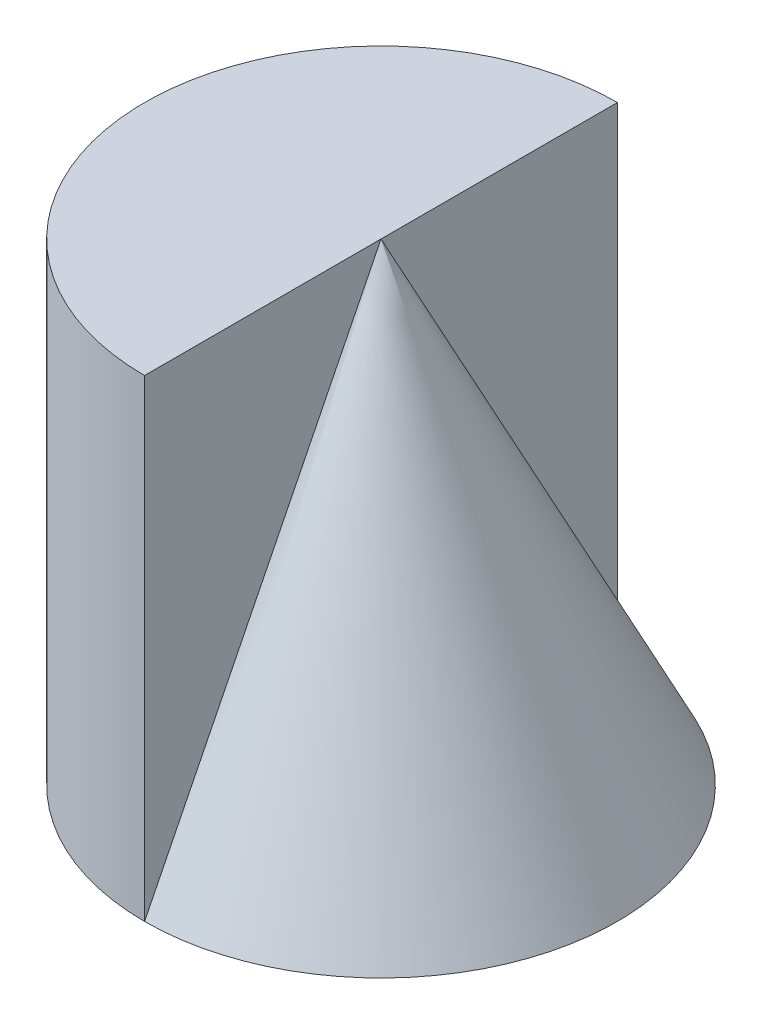
ISO-10303-21;
HEADER;
FILE_DESCRIPTION(('STEP AP214'),'2;1');
FILE_NAME('part.step','',(''),(''),'','','');
FILE_SCHEMA(('AUTOMOTIVE_DESIGN { 1 0 10303 214 1 1 1 1 }'));
ENDSEC;
DATA;
#1=APPLICATION_CONTEXT('core data for automotive mechanical design processes');
#2=APPLICATION_PROTOCOL_DEFINITION('international standard','automotive_design',2000,#1);
#3=PRODUCT_CONTEXT('',#1,'mechanical');
#4=PRODUCT('Part','Part','',(#3));
#5=PRODUCT_RELATED_PRODUCT_CATEGORY('part','',(#4));
#6=PRODUCT_DEFINITION_FORMATION('','',#4);
#7=PRODUCT_DEFINITION_CONTEXT('part definition',#1,'design');
#8=PRODUCT_DEFINITION('design','',#6,#7);
#9=PRODUCT_DEFINITION_SHAPE('','',#8);
#10=(LENGTH_UNIT() NAMED_UNIT(*) SI_UNIT(.MILLI.,.METRE.));
#11=(NAMED_UNIT(*) PLANE_ANGLE_UNIT() SI_UNIT($,.RADIAN.));
#12=(NAMED_UNIT(*) SI_UNIT($,.STERADIAN.) SOLID_ANGLE_UNIT());
#13=UNCERTAINTY_MEASURE_WITH_UNIT(LENGTH_MEASURE(1.E-05),#10,'distance_accuracy_value','');
#14=(GEOMETRIC_REPRESENTATION_CONTEXT(3) GLOBAL_UNCERTAINTY_ASSIGNED_CONTEXT((#13)) GLOBAL_UNIT_ASSIGNED_CONTEXT((#10,
#11,#12)) REPRESENTATION_CONTEXT('',''));
#15=CARTESIAN_POINT('',(0.,0.,0.));
#16=DIRECTION('',(0.,0.,1.));
#17=DIRECTION('',(1.,0.,0.));
#18=AXIS2_PLACEMENT_3D('',#15,#16,#17);
#19=CARTESIAN_POINT('',(0.,0.,4.));
#20=DIRECTION('',(0.,1.,0.));
#21=DIRECTION('',(0.,0.,1.));
#22=AXIS2_PLACEMENT_3D('',#19,#20,#21);
#23=PLANE('',#22);
#24=CARTESIAN_POINT('',(2.,0.,2.));
#25=DIRECTION('',(0.,1.,0.));
#26=DIRECTION('',(0.,0.,1.));
#27=AXIS2_PLACEMENT_3D('',#24,#25,#26);
#28=CIRCLE('',#27,2.);
#29=CARTESIAN_POINT('',(2.,0.,0.));
#30=VERTEX_POINT('',#29);
#31=CARTESIAN_POINT('',(1.99999999999999,0.,4.));
#32=VERTEX_POINT('',#31);
#33=EDGE_CURVE('E57',#30,#32,#28,.T.);
#34=ORIENTED_EDGE('',*,*,#33,.F.);
#35=CARTESIAN_POINT('',(2.,0.,2.));
#36=DIRECTION('',(0.,1.,0.));
#37=DIRECTION('',(0.,0.,1.));
#38=AXIS2_PLACEMENT_3D('',#35,#36,#37);
#39=CIRCLE('',#38,2.);
#40=EDGE_CURVE('E67',#32,#30,#39,.T.);
#41=ORIENTED_EDGE('',*,*,#40,.F.);
#42=EDGE_LOOP('',(#34,#41));
#43=FACE_BOUND('',#42,.T.);
#44=ADVANCED_FACE('F35',(#43),#23,.F.);
#45=CARTESIAN_POINT('',(0.,4.,4.));
#46=DIRECTION('',(0.,-1.,0.));
#47=DIRECTION('',(0.,0.,-1.));
#48=AXIS2_PLACEMENT_3D('',#45,#46,#47);
#49=PLANE('',#48);
#50=DIRECTION('',(0.,0.,-1.));
#51=VECTOR('',#50,1.);
#52=CARTESIAN_POINT('',(2.,4.,4.));
#53=LINE('',#52,#51);
#54=CARTESIAN_POINT('',(2.,4.,2.));
#55=VERTEX_POINT('',#54);
#56=CARTESIAN_POINT('',(2.,4.,0.));
#57=VERTEX_POINT('',#56);
#58=EDGE_CURVE('E42',#55,#57,#53,.T.);
#59=ORIENTED_EDGE('',*,*,#58,.T.);
#60=CARTESIAN_POINT('',(2.,4.,2.));
#61=DIRECTION('',(0.,1.,0.));
#62=DIRECTION('',(0.,0.,1.));
#63=AXIS2_PLACEMENT_3D('',#60,#61,#62);
#64=CIRCLE('',#63,2.);
#65=CARTESIAN_POINT('',(2.,4.,4.));
#66=VERTEX_POINT('',#65);
#67=EDGE_CURVE('E69',#57,#66,#64,.T.);
#68=ORIENTED_EDGE('',*,*,#67,.T.);
#69=EDGE_CURVE('E11',#66,#55,#53,.T.);
#70=ORIENTED_EDGE('',*,*,#69,.T.);
#71=EDGE_LOOP('',(#59,#68,#70));
#72=FACE_BOUND('',#71,.T.);
#73=ADVANCED_FACE('F88',(#72),#49,.F.);
#74=CARTESIAN_POINT('',(2.,0.,4.));
#75=DIRECTION('',(-1.,0.,0.));
#76=DIRECTION('',(0.,0.,1.));
#77=AXIS2_PLACEMENT_3D('',#74,#75,#76);
#78=PLANE('',#77);
#79=DIRECTION('',(0.,0.894427190999916,0.447213595499958));
#80=VECTOR('',#79,1.);
#81=CARTESIAN_POINT('',(2.,4.,2.));
#82=LINE('',#81,#80);
#83=EDGE_CURVE('E68',#30,#55,#82,.T.);
#84=ORIENTED_EDGE('',*,*,#83,.F.);
#85=DIRECTION('',(0.,1.,0.));
#86=VECTOR('',#85,1.);
#87=CARTESIAN_POINT('',(2.,0.,0.));
#88=LINE('',#87,#86);
#89=EDGE_CURVE('E72',#30,#57,#88,.T.);
#90=ORIENTED_EDGE('',*,*,#89,.T.);
#91=ORIENTED_EDGE('',*,*,#58,.F.);
#92=EDGE_LOOP('',(#84,#90,#91));
#93=FACE_BOUND('',#92,.T.);
#94=ADVANCED_FACE('F80',(#93),#78,.F.);
#95=DIRECTION('',(0.,0.894427190999916,-0.447213595499958));
#96=VECTOR('',#95,1.);
#97=CARTESIAN_POINT('',(2.,4.,2.));
#98=LINE('',#97,#96);
#99=EDGE_CURVE('E49',#32,#55,#98,.T.);
#100=ORIENTED_EDGE('',*,*,#99,.T.);
#101=ORIENTED_EDGE('',*,*,#69,.F.);
#102=DIRECTION('',(0.,1.,0.));
#103=VECTOR('',#102,1.);
#104=CARTESIAN_POINT('',(2.,0.,4.));
#105=LINE('',#104,#103);
#106=EDGE_CURVE('E78',#32,#66,#105,.T.);
#107=ORIENTED_EDGE('',*,*,#106,.F.);
#108=EDGE_LOOP('',(#100,#101,#107));
#109=FACE_BOUND('',#108,.T.);
#110=ADVANCED_FACE('F89',(#109),#78,.F.);
#111=CARTESIAN_POINT('',(2.,0.,2.));
#112=DIRECTION('',(0.,-1.,0.));
#113=DIRECTION('',(0.,0.,-1.));
#114=AXIS2_PLACEMENT_3D('',#111,#112,#113);
#115=CONICAL_SURFACE('',#114,2.,0.463647609000806);
#116=ORIENTED_EDGE('',*,*,#99,.F.);
#117=ORIENTED_EDGE('',*,*,#40,.T.);
#118=ORIENTED_EDGE('',*,*,#83,.T.);
#119=EDGE_LOOP('',(#116,#117,#118));
#120=FACE_BOUND('',#119,.T.);
#121=ADVANCED_FACE('F83',(#120),#115,.T.);
#122=CARTESIAN_POINT('',(2.,0.,2.));
#123=DIRECTION('',(0.,1.,0.));
#124=DIRECTION('',(0.,0.,1.));
#125=AXIS2_PLACEMENT_3D('',#122,#123,#124);
#126=CYLINDRICAL_SURFACE('',#125,2.);
#127=ORIENTED_EDGE('',*,*,#67,.F.);
#128=ORIENTED_EDGE('',*,*,#89,.F.);
#129=ORIENTED_EDGE('',*,*,#33,.T.);
#130=ORIENTED_EDGE('',*,*,#106,.T.);
#131=EDGE_LOOP('',(#127,#128,#129,#130));
#132=FACE_BOUND('',#131,.T.);
#133=ADVANCED_FACE('F74',(#132),#126,.T.);
#134=CLOSED_SHELL('',(#44,#73,#94,#110,#121,#133));
#135=MANIFOLD_SOLID_BREP('B2',#134);
#136=ADVANCED_BREP_SHAPE_REPRESENTATION('',(#18,#135),#14);
#137=SHAPE_DEFINITION_REPRESENTATION(#9,#136);
ENDSEC;
END-ISO-10303-21;
